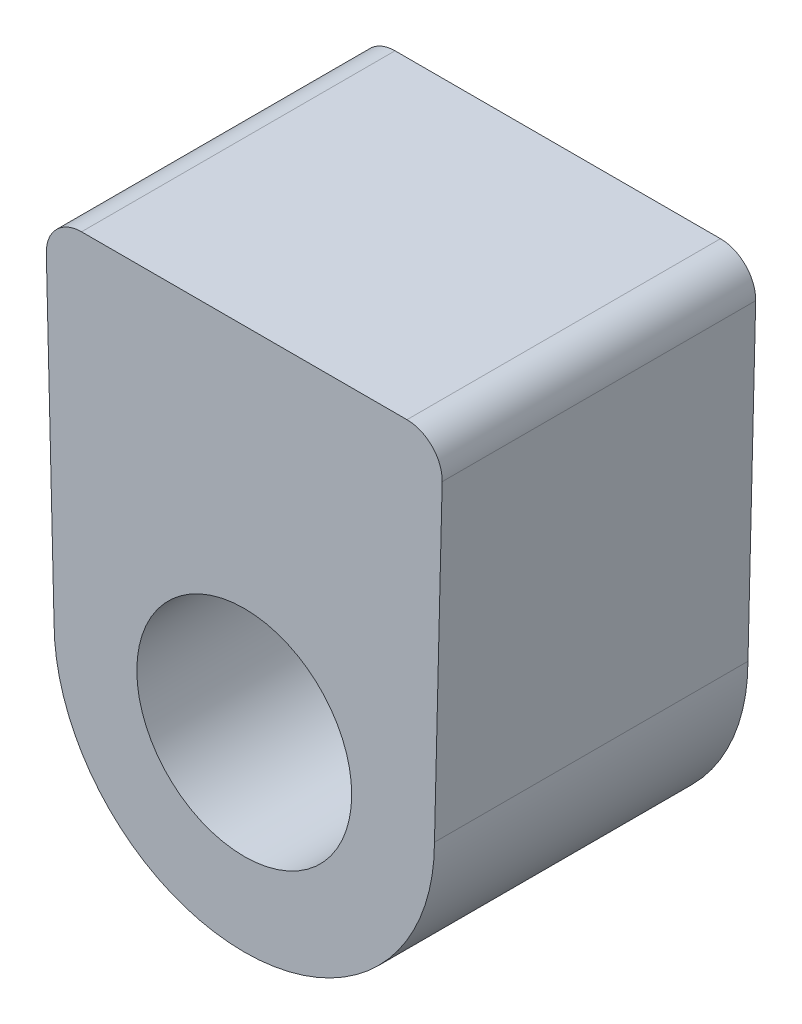
ISO-10303-21;
HEADER;
FILE_DESCRIPTION(('STEP AP214'),'2;1');
FILE_NAME('part.step','',(''),(''),'','','');
FILE_SCHEMA(('AUTOMOTIVE_DESIGN { 1 0 10303 214 1 1 1 1 }'));
ENDSEC;
DATA;
#1=APPLICATION_CONTEXT('core data for automotive mechanical design processes');
#2=APPLICATION_PROTOCOL_DEFINITION('international standard','automotive_design',2000,#1);
#3=PRODUCT_CONTEXT('',#1,'mechanical');
#4=PRODUCT('Part','Part','',(#3));
#5=PRODUCT_RELATED_PRODUCT_CATEGORY('part','',(#4));
#6=PRODUCT_DEFINITION_FORMATION('','',#4);
#7=PRODUCT_DEFINITION_CONTEXT('part definition',#1,'design');
#8=PRODUCT_DEFINITION('design','',#6,#7);
#9=PRODUCT_DEFINITION_SHAPE('','',#8);
#10=(LENGTH_UNIT() NAMED_UNIT(*) SI_UNIT(.MILLI.,.METRE.));
#11=(NAMED_UNIT(*) PLANE_ANGLE_UNIT() SI_UNIT($,.RADIAN.));
#12=(NAMED_UNIT(*) SI_UNIT($,.STERADIAN.) SOLID_ANGLE_UNIT());
#13=UNCERTAINTY_MEASURE_WITH_UNIT(LENGTH_MEASURE(1.E-05),#10,'distance_accuracy_value','');
#14=(GEOMETRIC_REPRESENTATION_CONTEXT(3) GLOBAL_UNCERTAINTY_ASSIGNED_CONTEXT((#13)) GLOBAL_UNIT_ASSIGNED_CONTEXT((#10,
#11,#12)) REPRESENTATION_CONTEXT('',''));
#15=CARTESIAN_POINT('',(0.,0.,0.));
#16=DIRECTION('',(0.,0.,1.));
#17=DIRECTION('',(1.,0.,0.));
#18=AXIS2_PLACEMENT_3D('',#15,#16,#17);
#19=CARTESIAN_POINT('',(0.,0.,-4.45));
#20=DIRECTION('',(0.,0.,1.));
#21=DIRECTION('',(1.,0.,0.));
#22=AXIS2_PLACEMENT_3D('',#19,#20,#21);
#23=CYLINDRICAL_SURFACE('',#22,5.4);
#24=DIRECTION('',(0.,0.,1.));
#25=VECTOR('',#24,1.);
#26=CARTESIAN_POINT('',(5.4,0.,-4.45));
#27=LINE('',#26,#25);
#28=CARTESIAN_POINT('',(5.4,0.,-4.45));
#29=VERTEX_POINT('',#28);
#30=CARTESIAN_POINT('',(5.4,0.,4.45));
#31=VERTEX_POINT('',#30);
#32=EDGE_CURVE('E88',#29,#31,#27,.T.);
#33=ORIENTED_EDGE('',*,*,#32,.T.);
#34=CARTESIAN_POINT('',(0.,0.,4.45));
#35=DIRECTION('',(0.,0.,1.));
#36=DIRECTION('',(1.,0.,0.));
#37=AXIS2_PLACEMENT_3D('',#34,#35,#36);
#38=CIRCLE('',#37,5.4);
#39=CARTESIAN_POINT('',(-5.4,0.,4.45));
#40=VERTEX_POINT('',#39);
#41=EDGE_CURVE('E92',#40,#31,#38,.T.);
#42=ORIENTED_EDGE('',*,*,#41,.F.);
#43=DIRECTION('',(0.,0.,1.));
#44=VECTOR('',#43,1.);
#45=CARTESIAN_POINT('',(-5.4,0.,-4.45));
#46=LINE('',#45,#44);
#47=CARTESIAN_POINT('',(-5.4,0.,-4.45));
#48=VERTEX_POINT('',#47);
#49=EDGE_CURVE('E96',#48,#40,#46,.T.);
#50=ORIENTED_EDGE('',*,*,#49,.F.);
#51=CARTESIAN_POINT('',(0.,0.,-4.45));
#52=DIRECTION('',(0.,0.,1.));
#53=DIRECTION('',(1.,0.,0.));
#54=AXIS2_PLACEMENT_3D('',#51,#52,#53);
#55=CIRCLE('',#54,5.4);
#56=EDGE_CURVE('E94',#48,#29,#55,.T.);
#57=ORIENTED_EDGE('',*,*,#56,.T.);
#58=EDGE_LOOP('',(#33,#42,#50,#57));
#59=FACE_BOUND('',#58,.T.);
#60=ADVANCED_FACE('F32',(#59),#23,.T.);
#61=CARTESIAN_POINT('',(-5.4,0.,-4.45));
#62=DIRECTION('',(-0.999701489781183,-0.0244321781526501,0.));
#63=DIRECTION('',(0.0244321781526501,-0.999701489781183,0.));
#64=AXIS2_PLACEMENT_3D('',#61,#62,#63);
#65=PLANE('',#64);
#66=DIRECTION('',(0.0244321781526501,-0.999701489781183,0.));
#67=VECTOR('',#66,1.);
#68=CARTESIAN_POINT('',(-5.4,0.,4.45));
#69=LINE('',#68,#67);
#70=CARTESIAN_POINT('',(-5.61935815269473,8.97556782184735,4.45));
#71=VERTEX_POINT('',#70);
#72=EDGE_CURVE('E109',#71,#40,#69,.T.);
#73=ORIENTED_EDGE('',*,*,#72,.F.);
#74=DIRECTION('',(0.,0.,1.));
#75=VECTOR('',#74,1.);
#76=CARTESIAN_POINT('',(-5.61935815269473,8.97556782184735,-4.45));
#77=LINE('',#76,#75);
#78=CARTESIAN_POINT('',(-5.61935815269473,8.97556782184735,-4.45));
#79=VERTEX_POINT('',#78);
#80=EDGE_CURVE('E55',#71,#79,#77,.F.);
#81=ORIENTED_EDGE('',*,*,#80,.T.);
#82=DIRECTION('',(0.0244321781526501,-0.999701489781183,0.));
#83=VECTOR('',#82,1.);
#84=CARTESIAN_POINT('',(-5.4,0.,-4.45));
#85=LINE('',#84,#83);
#86=EDGE_CURVE('E97',#79,#48,#85,.T.);
#87=ORIENTED_EDGE('',*,*,#86,.T.);
#88=ORIENTED_EDGE('',*,*,#49,.T.);
#89=EDGE_LOOP('',(#73,#81,#87,#88));
#90=FACE_BOUND('',#89,.T.);
#91=ADVANCED_FACE('F150',(#90),#65,.T.);
#92=CARTESIAN_POINT('',(-5.64439473585258,10.,-4.45));
#93=DIRECTION('',(0.,1.,0.));
#94=DIRECTION('',(-1.,0.,0.));
#95=AXIS2_PLACEMENT_3D('',#92,#93,#94);
#96=PLANE('',#95);
#97=DIRECTION('',(-1.,0.,0.));
#98=VECTOR('',#97,1.);
#99=CARTESIAN_POINT('',(-5.64439473585258,10.,-4.45));
#100=LINE('',#99,#98);
#101=CARTESIAN_POINT('',(4.61965666291355,10.,-4.45));
#102=VERTEX_POINT('',#101);
#103=CARTESIAN_POINT('',(-4.61965666291355,10.,-4.45));
#104=VERTEX_POINT('',#103);
#105=EDGE_CURVE('E126',#102,#104,#100,.T.);
#106=ORIENTED_EDGE('',*,*,#105,.T.);
#107=DIRECTION('',(0.,0.,1.));
#108=VECTOR('',#107,1.);
#109=CARTESIAN_POINT('',(-4.61965666291355,10.,-4.45));
#110=LINE('',#109,#108);
#111=CARTESIAN_POINT('',(-4.61965666291355,10.,4.45));
#112=VERTEX_POINT('',#111);
#113=EDGE_CURVE('E133',#104,#112,#110,.T.);
#114=ORIENTED_EDGE('',*,*,#113,.T.);
#115=DIRECTION('',(-1.,0.,0.));
#116=VECTOR('',#115,1.);
#117=CARTESIAN_POINT('',(-5.64439473585258,10.,4.45));
#118=LINE('',#117,#116);
#119=CARTESIAN_POINT('',(4.61965666291355,10.,4.45));
#120=VERTEX_POINT('',#119);
#121=EDGE_CURVE('E104',#120,#112,#118,.T.);
#122=ORIENTED_EDGE('',*,*,#121,.F.);
#123=DIRECTION('',(0.,0.,1.));
#124=VECTOR('',#123,1.);
#125=CARTESIAN_POINT('',(4.61965666291355,10.,-4.45));
#126=LINE('',#125,#124);
#127=EDGE_CURVE('E130',#120,#102,#126,.F.);
#128=ORIENTED_EDGE('',*,*,#127,.T.);
#129=EDGE_LOOP('',(#106,#114,#122,#128));
#130=FACE_BOUND('',#129,.T.);
#131=ADVANCED_FACE('F146',(#130),#96,.T.);
#132=CARTESIAN_POINT('',(5.64439473585258,10.,-4.45));
#133=DIRECTION('',(0.999701489781183,-0.0244321781526499,0.));
#134=DIRECTION('',(0.0244321781526499,0.999701489781183,0.));
#135=AXIS2_PLACEMENT_3D('',#132,#133,#134);
#136=PLANE('',#135);
#137=DIRECTION('',(0.0244321781526499,0.999701489781183,0.));
#138=VECTOR('',#137,1.);
#139=CARTESIAN_POINT('',(5.64439473585258,10.,-4.45));
#140=LINE('',#139,#138);
#141=CARTESIAN_POINT('',(5.61935815269473,8.97556782184735,-4.45));
#142=VERTEX_POINT('',#141);
#143=EDGE_CURVE('E124',#29,#142,#140,.T.);
#144=ORIENTED_EDGE('',*,*,#143,.T.);
#145=DIRECTION('',(0.,0.,1.));
#146=VECTOR('',#145,1.);
#147=CARTESIAN_POINT('',(5.61935815269473,8.97556782184735,-4.45));
#148=LINE('',#147,#146);
#149=CARTESIAN_POINT('',(5.61935815269473,8.97556782184735,4.45));
#150=VERTEX_POINT('',#149);
#151=EDGE_CURVE('E11',#142,#150,#148,.T.);
#152=ORIENTED_EDGE('',*,*,#151,.T.);
#153=DIRECTION('',(0.0244321781526499,0.999701489781183,0.));
#154=VECTOR('',#153,1.);
#155=CARTESIAN_POINT('',(5.64439473585258,10.,4.45));
#156=LINE('',#155,#154);
#157=EDGE_CURVE('E100',#31,#150,#156,.T.);
#158=ORIENTED_EDGE('',*,*,#157,.F.);
#159=ORIENTED_EDGE('',*,*,#32,.F.);
#160=EDGE_LOOP('',(#144,#152,#158,#159));
#161=FACE_BOUND('',#160,.T.);
#162=ADVANCED_FACE('F101',(#161),#136,.T.);
#163=CARTESIAN_POINT('',(0.,0.,-4.45));
#164=DIRECTION('',(0.,0.,1.));
#165=DIRECTION('',(1.,0.,0.));
#166=AXIS2_PLACEMENT_3D('',#163,#164,#165);
#167=PLANE('',#166);
#168=CARTESIAN_POINT('',(2.5,7.75,-4.45));
#169=DIRECTION('',(0.,0.,-1.));
#170=DIRECTION('',(-1.,0.,0.));
#171=AXIS2_PLACEMENT_3D('',#168,#169,#170);
#172=CIRCLE('',#171,0.624999999999999);
#173=CARTESIAN_POINT('',(1.875,7.75,-4.45));
#174=VERTEX_POINT('',#173);
#175=EDGE_CURVE('E199',#174,#174,#172,.T.);
#176=ORIENTED_EDGE('',*,*,#175,.F.);
#177=EDGE_LOOP('',(#176));
#178=FACE_BOUND('',#177,.T.);
#179=CARTESIAN_POINT('',(-2.5,7.75,-4.45));
#180=DIRECTION('',(0.,0.,-1.));
#181=DIRECTION('',(-1.,0.,0.));
#182=AXIS2_PLACEMENT_3D('',#179,#180,#181);
#183=CIRCLE('',#182,0.624999999999999);
#184=CARTESIAN_POINT('',(-3.125,7.75,-4.45));
#185=VERTEX_POINT('',#184);
#186=EDGE_CURVE('E201',#185,#185,#183,.T.);
#187=ORIENTED_EDGE('',*,*,#186,.F.);
#188=EDGE_LOOP('',(#187));
#189=FACE_BOUND('',#188,.T.);
#190=CARTESIAN_POINT('',(0.,0.,-4.45));
#191=DIRECTION('',(0.,0.,1.));
#192=DIRECTION('',(1.,0.,0.));
#193=AXIS2_PLACEMENT_3D('',#190,#191,#192);
#194=CIRCLE('',#193,3.05);
#195=CARTESIAN_POINT('',(3.05,0.,-4.45));
#196=VERTEX_POINT('',#195);
#197=EDGE_CURVE('E120',#196,#196,#194,.T.);
#198=ORIENTED_EDGE('',*,*,#197,.T.);
#199=EDGE_LOOP('',(#198));
#200=FACE_BOUND('',#199,.T.);
#201=ORIENTED_EDGE('',*,*,#86,.F.);
#202=CARTESIAN_POINT('',(-4.61965666291355,9.,-4.45));
#203=DIRECTION('',(0.,0.,1.));
#204=DIRECTION('',(1.,0.,0.));
#205=AXIS2_PLACEMENT_3D('',#202,#203,#204);
#206=CIRCLE('',#205,1.);
#207=EDGE_CURVE('E40',#79,#104,#206,.F.);
#208=ORIENTED_EDGE('',*,*,#207,.T.);
#209=ORIENTED_EDGE('',*,*,#105,.F.);
#210=CARTESIAN_POINT('',(4.61965666291355,9.,-4.45));
#211=DIRECTION('',(0.,0.,1.));
#212=DIRECTION('',(1.,0.,0.));
#213=AXIS2_PLACEMENT_3D('',#210,#211,#212);
#214=CIRCLE('',#213,1.);
#215=EDGE_CURVE('E47',#102,#142,#214,.F.);
#216=ORIENTED_EDGE('',*,*,#215,.T.);
#217=ORIENTED_EDGE('',*,*,#143,.F.);
#218=ORIENTED_EDGE('',*,*,#56,.F.);
#219=EDGE_LOOP('',(#201,#208,#209,#216,#217,#218));
#220=FACE_BOUND('',#219,.T.);
#221=ADVANCED_FACE('F142',(#178,#189,#200,#220),#167,.F.);
#222=CARTESIAN_POINT('',(0.,0.,-4.45));
#223=DIRECTION('',(0.,0.,1.));
#224=DIRECTION('',(1.,0.,0.));
#225=AXIS2_PLACEMENT_3D('',#222,#223,#224);
#226=CYLINDRICAL_SURFACE('',#225,3.05);
#227=ORIENTED_EDGE('',*,*,#197,.F.);
#228=EDGE_LOOP('',(#227));
#229=FACE_BOUND('',#228,.T.);
#230=CARTESIAN_POINT('',(0.,0.,4.45));
#231=DIRECTION('',(0.,0.,1.));
#232=DIRECTION('',(1.,0.,0.));
#233=AXIS2_PLACEMENT_3D('',#230,#231,#232);
#234=CIRCLE('',#233,3.05);
#235=CARTESIAN_POINT('',(3.05,0.,4.45));
#236=VERTEX_POINT('',#235);
#237=EDGE_CURVE('E111',#236,#236,#234,.T.);
#238=ORIENTED_EDGE('',*,*,#237,.T.);
#239=EDGE_LOOP('',(#238));
#240=FACE_BOUND('',#239,.T.);
#241=ADVANCED_FACE('F170',(#229,#240),#226,.F.);
#242=CARTESIAN_POINT('',(0.,0.,4.45));
#243=DIRECTION('',(0.,0.,1.));
#244=DIRECTION('',(1.,0.,0.));
#245=AXIS2_PLACEMENT_3D('',#242,#243,#244);
#246=PLANE('',#245);
#247=ORIENTED_EDGE('',*,*,#121,.T.);
#248=CARTESIAN_POINT('',(-4.61965666291355,9.,4.45));
#249=DIRECTION('',(0.,0.,1.));
#250=DIRECTION('',(1.,0.,0.));
#251=AXIS2_PLACEMENT_3D('',#248,#249,#250);
#252=CIRCLE('',#251,1.);
#253=EDGE_CURVE('E138',#112,#71,#252,.T.);
#254=ORIENTED_EDGE('',*,*,#253,.T.);
#255=ORIENTED_EDGE('',*,*,#72,.T.);
#256=ORIENTED_EDGE('',*,*,#41,.T.);
#257=ORIENTED_EDGE('',*,*,#157,.T.);
#258=CARTESIAN_POINT('',(4.61965666291355,9.,4.45));
#259=DIRECTION('',(0.,0.,1.));
#260=DIRECTION('',(1.,0.,0.));
#261=AXIS2_PLACEMENT_3D('',#258,#259,#260);
#262=CIRCLE('',#261,1.);
#263=EDGE_CURVE('E136',#150,#120,#262,.T.);
#264=ORIENTED_EDGE('',*,*,#263,.T.);
#265=EDGE_LOOP('',(#247,#254,#255,#256,#257,#264));
#266=FACE_BOUND('',#265,.T.);
#267=ORIENTED_EDGE('',*,*,#237,.F.);
#268=EDGE_LOOP('',(#267));
#269=FACE_BOUND('',#268,.T.);
#270=ADVANCED_FACE('F107',(#266,#269),#246,.T.);
#271=CARTESIAN_POINT('',(-2.5,7.75,0.550000000000001));
#272=DIRECTION('',(0.,0.,1.));
#273=DIRECTION('',(1.,0.,0.));
#274=AXIS2_PLACEMENT_3D('',#271,#272,#273);
#275=PLANE('',#274);
#276=CARTESIAN_POINT('',(-2.5,7.75,0.55));
#277=DIRECTION('',(0.,0.,-1.));
#278=DIRECTION('',(-1.,0.,0.));
#279=AXIS2_PLACEMENT_3D('',#276,#277,#278);
#280=CIRCLE('',#279,0.624999999999999);
#281=CARTESIAN_POINT('',(-3.125,7.75,0.55));
#282=VERTEX_POINT('',#281);
#283=EDGE_CURVE('E114',#282,#282,#280,.T.);
#284=ORIENTED_EDGE('',*,*,#283,.T.);
#285=EDGE_LOOP('',(#284));
#286=FACE_BOUND('',#285,.T.);
#287=ADVANCED_FACE('F177',(#286),#275,.F.);
#288=CARTESIAN_POINT('',(-2.5,7.75,-4.45));
#289=DIRECTION('',(0.,0.,-1.));
#290=DIRECTION('',(-1.,0.,0.));
#291=AXIS2_PLACEMENT_3D('',#288,#289,#290);
#292=CYLINDRICAL_SURFACE('',#291,0.624999999999999);
#293=ORIENTED_EDGE('',*,*,#283,.F.);
#294=EDGE_LOOP('',(#293));
#295=FACE_BOUND('',#294,.T.);
#296=ORIENTED_EDGE('',*,*,#186,.T.);
#297=EDGE_LOOP('',(#296));
#298=FACE_BOUND('',#297,.T.);
#299=ADVANCED_FACE('F180',(#295,#298),#292,.F.);
#300=CARTESIAN_POINT('',(2.5,7.75,0.550000000000001));
#301=DIRECTION('',(0.,0.,1.));
#302=DIRECTION('',(1.,0.,0.));
#303=AXIS2_PLACEMENT_3D('',#300,#301,#302);
#304=PLANE('',#303);
#305=CARTESIAN_POINT('',(2.5,7.75,0.55));
#306=DIRECTION('',(0.,0.,-1.));
#307=DIRECTION('',(-1.,0.,0.));
#308=AXIS2_PLACEMENT_3D('',#305,#306,#307);
#309=CIRCLE('',#308,0.624999999999999);
#310=CARTESIAN_POINT('',(1.875,7.75,0.55));
#311=VERTEX_POINT('',#310);
#312=EDGE_CURVE('E196',#311,#311,#309,.T.);
#313=ORIENTED_EDGE('',*,*,#312,.T.);
#314=EDGE_LOOP('',(#313));
#315=FACE_BOUND('',#314,.T.);
#316=ADVANCED_FACE('F184',(#315),#304,.F.);
#317=CARTESIAN_POINT('',(2.5,7.75,-4.45));
#318=DIRECTION('',(0.,0.,-1.));
#319=DIRECTION('',(-1.,0.,0.));
#320=AXIS2_PLACEMENT_3D('',#317,#318,#319);
#321=CYLINDRICAL_SURFACE('',#320,0.624999999999999);
#322=ORIENTED_EDGE('',*,*,#312,.F.);
#323=EDGE_LOOP('',(#322));
#324=FACE_BOUND('',#323,.T.);
#325=ORIENTED_EDGE('',*,*,#175,.T.);
#326=EDGE_LOOP('',(#325));
#327=FACE_BOUND('',#326,.T.);
#328=ADVANCED_FACE('F156',(#324,#327),#321,.F.);
#329=CARTESIAN_POINT('',(-4.61965666291355,9.,-4.45));
#330=DIRECTION('',(0.,0.,1.));
#331=DIRECTION('',(1.,0.,0.));
#332=AXIS2_PLACEMENT_3D('',#329,#330,#331);
#333=CYLINDRICAL_SURFACE('',#332,1.);
#334=ORIENTED_EDGE('',*,*,#207,.F.);
#335=ORIENTED_EDGE('',*,*,#80,.F.);
#336=ORIENTED_EDGE('',*,*,#253,.F.);
#337=ORIENTED_EDGE('',*,*,#113,.F.);
#338=EDGE_LOOP('',(#334,#335,#336,#337));
#339=FACE_BOUND('',#338,.T.);
#340=ADVANCED_FACE('F149',(#339),#333,.T.);
#341=CARTESIAN_POINT('',(4.61965666291355,9.,-4.45));
#342=DIRECTION('',(0.,0.,1.));
#343=DIRECTION('',(1.,0.,0.));
#344=AXIS2_PLACEMENT_3D('',#341,#342,#343);
#345=CYLINDRICAL_SURFACE('',#344,1.);
#346=ORIENTED_EDGE('',*,*,#215,.F.);
#347=ORIENTED_EDGE('',*,*,#127,.F.);
#348=ORIENTED_EDGE('',*,*,#263,.F.);
#349=ORIENTED_EDGE('',*,*,#151,.F.);
#350=EDGE_LOOP('',(#346,#347,#348,#349));
#351=FACE_BOUND('',#350,.T.);
#352=ADVANCED_FACE('F34',(#351),#345,.T.);
#353=CLOSED_SHELL('',(#60,#91,#131,#162,#221,#241,#270,#287,#299,#316,#328,#340,#352));
#354=MANIFOLD_SOLID_BREP('B2',#353);
#355=ADVANCED_BREP_SHAPE_REPRESENTATION('',(#18,#354),#14);
#356=SHAPE_DEFINITION_REPRESENTATION(#9,#355);
ENDSEC;
END-ISO-10303-21;
